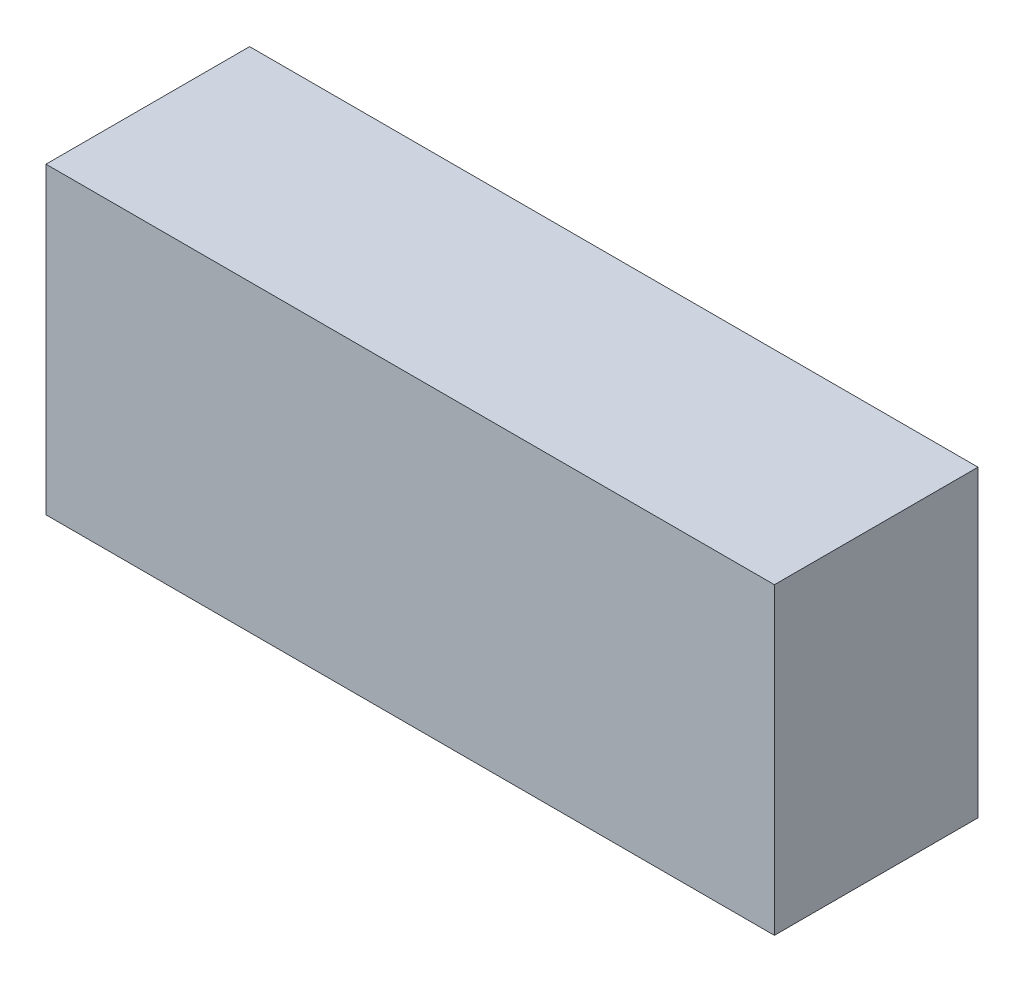
ISO-10303-21;
HEADER;
FILE_DESCRIPTION(('STEP AP214'),'2;1');
FILE_NAME('part.step','',(''),(''),'','','');
FILE_SCHEMA(('AUTOMOTIVE_DESIGN { 1 0 10303 214 1 1 1 1 }'));
ENDSEC;
DATA;
#1=APPLICATION_CONTEXT('core data for automotive mechanical design processes');
#2=APPLICATION_PROTOCOL_DEFINITION('international standard','automotive_design',2000,#1);
#3=PRODUCT_CONTEXT('',#1,'mechanical');
#4=PRODUCT('Part','Part','',(#3));
#5=PRODUCT_RELATED_PRODUCT_CATEGORY('part','',(#4));
#6=PRODUCT_DEFINITION_FORMATION('','',#4);
#7=PRODUCT_DEFINITION_CONTEXT('part definition',#1,'design');
#8=PRODUCT_DEFINITION('design','',#6,#7);
#9=PRODUCT_DEFINITION_SHAPE('','',#8);
#10=(LENGTH_UNIT() NAMED_UNIT(*) SI_UNIT(.MILLI.,.METRE.));
#11=(NAMED_UNIT(*) PLANE_ANGLE_UNIT() SI_UNIT($,.RADIAN.));
#12=(NAMED_UNIT(*) SI_UNIT($,.STERADIAN.) SOLID_ANGLE_UNIT());
#13=UNCERTAINTY_MEASURE_WITH_UNIT(LENGTH_MEASURE(1.E-05),#10,'distance_accuracy_value','');
#14=(GEOMETRIC_REPRESENTATION_CONTEXT(3) GLOBAL_UNCERTAINTY_ASSIGNED_CONTEXT((#13)) GLOBAL_UNIT_ASSIGNED_CONTEXT((#10,
#11,#12)) REPRESENTATION_CONTEXT('',''));
#15=CARTESIAN_POINT('',(0.,0.,0.));
#16=DIRECTION('',(0.,0.,1.));
#17=DIRECTION('',(1.,0.,0.));
#18=AXIS2_PLACEMENT_3D('',#15,#16,#17);
#19=CARTESIAN_POINT('',(-21.62699764,-9.017,12.09000122));
#20=DIRECTION('',(0.,0.,1.));
#21=DIRECTION('',(1.,0.,0.));
#22=AXIS2_PLACEMENT_3D('',#19,#20,#21);
#23=PLANE('',#22);
#24=DIRECTION('',(1.,0.,0.));
#25=VECTOR('',#24,1.);
#26=CARTESIAN_POINT('',(-21.62699764,9.017,12.09000122));
#27=LINE('',#26,#25);
#28=CARTESIAN_POINT('',(-21.62699764,9.017,12.09000122));
#29=VERTEX_POINT('',#28);
#30=CARTESIAN_POINT('',(21.62700018,9.017,12.09000122));
#31=VERTEX_POINT('',#30);
#32=EDGE_CURVE('E53',#29,#31,#27,.T.);
#33=ORIENTED_EDGE('',*,*,#32,.F.);
#34=DIRECTION('',(0.,1.,0.));
#35=VECTOR('',#34,1.);
#36=CARTESIAN_POINT('',(-21.62699764,-9.017,12.09000122));
#37=LINE('',#36,#35);
#38=CARTESIAN_POINT('',(-21.62699764,-9.017,12.09000122));
#39=VERTEX_POINT('',#38);
#40=EDGE_CURVE('E68',#39,#29,#37,.T.);
#41=ORIENTED_EDGE('',*,*,#40,.F.);
#42=DIRECTION('',(1.,0.,0.));
#43=VECTOR('',#42,1.);
#44=CARTESIAN_POINT('',(21.62700018,-9.017,12.09000122));
#45=LINE('',#44,#43);
#46=CARTESIAN_POINT('',(21.62700018,-9.017,12.09000122));
#47=VERTEX_POINT('',#46);
#48=EDGE_CURVE('E20',#47,#39,#45,.F.);
#49=ORIENTED_EDGE('',*,*,#48,.F.);
#50=DIRECTION('',(0.,1.,0.));
#51=VECTOR('',#50,1.);
#52=CARTESIAN_POINT('',(21.62700018,9.017,12.09000122));
#53=LINE('',#52,#51);
#54=EDGE_CURVE('E58',#31,#47,#53,.F.);
#55=ORIENTED_EDGE('',*,*,#54,.F.);
#56=EDGE_LOOP('',(#33,#41,#49,#55));
#57=FACE_BOUND('',#56,.T.);
#58=ADVANCED_FACE('F17',(#57),#23,.T.);
#59=CARTESIAN_POINT('',(21.62700018,-9.017,0.));
#60=DIRECTION('',(0.,-1.,0.));
#61=DIRECTION('',(0.,0.,-1.));
#62=AXIS2_PLACEMENT_3D('',#59,#60,#61);
#63=PLANE('',#62);
#64=DIRECTION('',(0.,0.,1.));
#65=VECTOR('',#64,1.);
#66=CARTESIAN_POINT('',(-21.62699764,-9.017,0.));
#67=LINE('',#66,#65);
#68=CARTESIAN_POINT('',(-21.62699764,-9.017,0.));
#69=VERTEX_POINT('',#68);
#70=EDGE_CURVE('E79',#69,#39,#67,.T.);
#71=ORIENTED_EDGE('',*,*,#70,.F.);
#72=DIRECTION('',(1.,0.,0.));
#73=VECTOR('',#72,1.);
#74=CARTESIAN_POINT('',(-21.62699764,-9.017,0.));
#75=LINE('',#74,#73);
#76=CARTESIAN_POINT('',(21.62700018,-9.017,0.));
#77=VERTEX_POINT('',#76);
#78=EDGE_CURVE('E74',#69,#77,#75,.T.);
#79=ORIENTED_EDGE('',*,*,#78,.T.);
#80=DIRECTION('',(0.,0.,-1.));
#81=VECTOR('',#80,1.);
#82=CARTESIAN_POINT('',(21.62700018,-9.017,0.));
#83=LINE('',#82,#81);
#84=EDGE_CURVE('E63',#47,#77,#83,.T.);
#85=ORIENTED_EDGE('',*,*,#84,.F.);
#86=ORIENTED_EDGE('',*,*,#48,.T.);
#87=EDGE_LOOP('',(#71,#79,#85,#86));
#88=FACE_BOUND('',#87,.T.);
#89=ADVANCED_FACE('F73',(#88),#63,.T.);
#90=CARTESIAN_POINT('',(21.62700018,9.017,0.));
#91=DIRECTION('',(1.,0.,0.));
#92=DIRECTION('',(0.,0.,-1.));
#93=AXIS2_PLACEMENT_3D('',#90,#91,#92);
#94=PLANE('',#93);
#95=ORIENTED_EDGE('',*,*,#84,.T.);
#96=DIRECTION('',(0.,1.,0.));
#97=VECTOR('',#96,1.);
#98=CARTESIAN_POINT('',(21.62700018,-9.017,0.));
#99=LINE('',#98,#97);
#100=CARTESIAN_POINT('',(21.62700018,9.017,0.));
#101=VERTEX_POINT('',#100);
#102=EDGE_CURVE('E84',#77,#101,#99,.T.);
#103=ORIENTED_EDGE('',*,*,#102,.T.);
#104=DIRECTION('',(0.,0.,1.));
#105=VECTOR('',#104,1.);
#106=CARTESIAN_POINT('',(21.62700018,9.017,0.));
#107=LINE('',#106,#105);
#108=EDGE_CURVE('E65',#31,#101,#107,.F.);
#109=ORIENTED_EDGE('',*,*,#108,.F.);
#110=ORIENTED_EDGE('',*,*,#54,.T.);
#111=EDGE_LOOP('',(#95,#103,#109,#110));
#112=FACE_BOUND('',#111,.T.);
#113=ADVANCED_FACE('F60',(#112),#94,.T.);
#114=CARTESIAN_POINT('',(-21.62699764,9.017,0.));
#115=DIRECTION('',(0.,1.,0.));
#116=DIRECTION('',(0.,0.,1.));
#117=AXIS2_PLACEMENT_3D('',#114,#115,#116);
#118=PLANE('',#117);
#119=ORIENTED_EDGE('',*,*,#108,.T.);
#120=DIRECTION('',(1.,0.,0.));
#121=VECTOR('',#120,1.);
#122=CARTESIAN_POINT('',(-21.62699764,9.017,0.));
#123=LINE('',#122,#121);
#124=CARTESIAN_POINT('',(-21.62699764,9.017,0.));
#125=VERTEX_POINT('',#124);
#126=EDGE_CURVE('E26',#101,#125,#123,.F.);
#127=ORIENTED_EDGE('',*,*,#126,.T.);
#128=DIRECTION('',(0.,0.,1.));
#129=VECTOR('',#128,1.);
#130=CARTESIAN_POINT('',(-21.62699764,9.017,0.));
#131=LINE('',#130,#129);
#132=EDGE_CURVE('E34',#29,#125,#131,.F.);
#133=ORIENTED_EDGE('',*,*,#132,.F.);
#134=ORIENTED_EDGE('',*,*,#32,.T.);
#135=EDGE_LOOP('',(#119,#127,#133,#134));
#136=FACE_BOUND('',#135,.T.);
#137=ADVANCED_FACE('F88',(#136),#118,.T.);
#138=CARTESIAN_POINT('',(-21.62699764,-9.017,0.));
#139=DIRECTION('',(-1.,0.,0.));
#140=DIRECTION('',(0.,0.,1.));
#141=AXIS2_PLACEMENT_3D('',#138,#139,#140);
#142=PLANE('',#141);
#143=ORIENTED_EDGE('',*,*,#132,.T.);
#144=DIRECTION('',(0.,1.,0.));
#145=VECTOR('',#144,1.);
#146=CARTESIAN_POINT('',(-21.62699764,-9.017,0.));
#147=LINE('',#146,#145);
#148=EDGE_CURVE('E11',#125,#69,#147,.F.);
#149=ORIENTED_EDGE('',*,*,#148,.T.);
#150=ORIENTED_EDGE('',*,*,#70,.T.);
#151=ORIENTED_EDGE('',*,*,#40,.T.);
#152=EDGE_LOOP('',(#143,#149,#150,#151));
#153=FACE_BOUND('',#152,.T.);
#154=ADVANCED_FACE('F91',(#153),#142,.T.);
#155=CARTESIAN_POINT('',(-21.62699764,-9.017,0.));
#156=DIRECTION('',(0.,0.,1.));
#157=DIRECTION('',(1.,0.,0.));
#158=AXIS2_PLACEMENT_3D('',#155,#156,#157);
#159=PLANE('',#158);
#160=ORIENTED_EDGE('',*,*,#126,.F.);
#161=ORIENTED_EDGE('',*,*,#102,.F.);
#162=ORIENTED_EDGE('',*,*,#78,.F.);
#163=ORIENTED_EDGE('',*,*,#148,.F.);
#164=EDGE_LOOP('',(#160,#161,#162,#163));
#165=FACE_BOUND('',#164,.T.);
#166=ADVANCED_FACE('F90',(#165),#159,.F.);
#167=CLOSED_SHELL('',(#58,#89,#113,#137,#154,#166));
#168=MANIFOLD_SOLID_BREP('B1',#167);
#169=ADVANCED_BREP_SHAPE_REPRESENTATION('',(#18,#168),#14);
#170=SHAPE_DEFINITION_REPRESENTATION(#9,#169);
ENDSEC;
END-ISO-10303-21;
